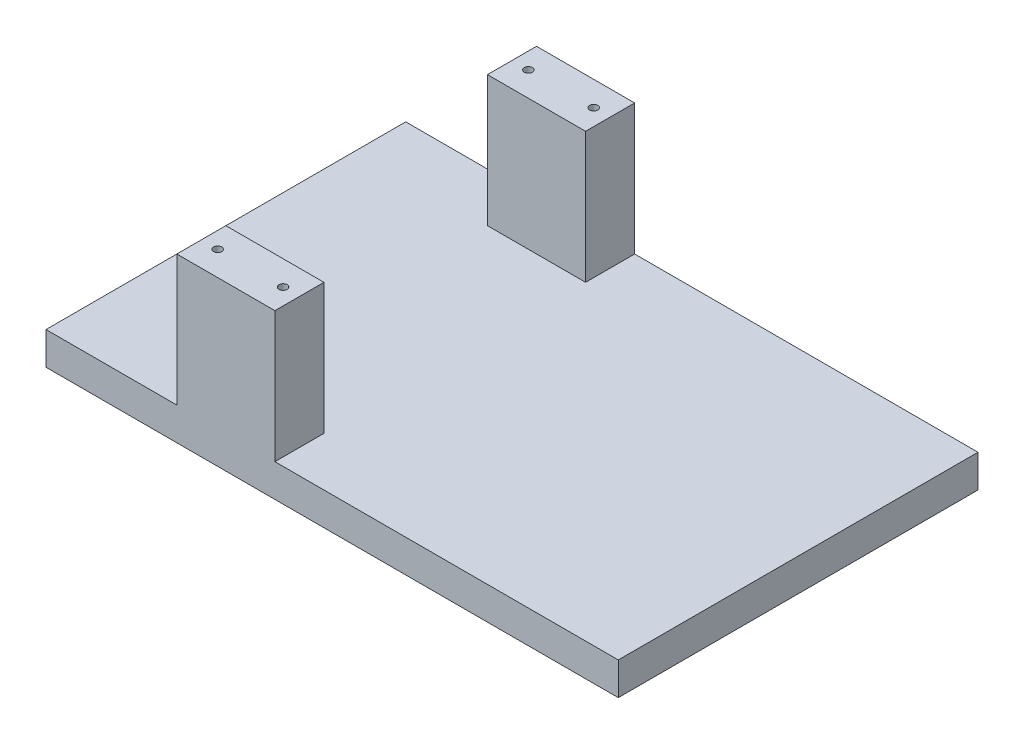
ISO-10303-21;
HEADER;
FILE_DESCRIPTION(('STEP AP214'),'2;1');
FILE_NAME('part.step','',(''),(''),'','','');
FILE_SCHEMA(('AUTOMOTIVE_DESIGN { 1 0 10303 214 1 1 1 1 }'));
ENDSEC;
DATA;
#1=APPLICATION_CONTEXT('core data for automotive mechanical design processes');
#2=APPLICATION_PROTOCOL_DEFINITION('international standard','automotive_design',2000,#1);
#3=PRODUCT_CONTEXT('',#1,'mechanical');
#4=PRODUCT('Part','Part','',(#3));
#5=PRODUCT_RELATED_PRODUCT_CATEGORY('part','',(#4));
#6=PRODUCT_DEFINITION_FORMATION('','',#4);
#7=PRODUCT_DEFINITION_CONTEXT('part definition',#1,'design');
#8=PRODUCT_DEFINITION('design','',#6,#7);
#9=PRODUCT_DEFINITION_SHAPE('','',#8);
#10=(LENGTH_UNIT() NAMED_UNIT(*) SI_UNIT(.MILLI.,.METRE.));
#11=(NAMED_UNIT(*) PLANE_ANGLE_UNIT() SI_UNIT($,.RADIAN.));
#12=(NAMED_UNIT(*) SI_UNIT($,.STERADIAN.) SOLID_ANGLE_UNIT());
#13=UNCERTAINTY_MEASURE_WITH_UNIT(LENGTH_MEASURE(1.E-05),#10,'distance_accuracy_value','');
#14=(GEOMETRIC_REPRESENTATION_CONTEXT(3) GLOBAL_UNCERTAINTY_ASSIGNED_CONTEXT((#13)) GLOBAL_UNIT_ASSIGNED_CONTEXT((#10,
#11,#12)) REPRESENTATION_CONTEXT('',''));
#15=CARTESIAN_POINT('',(0.,0.,0.));
#16=DIRECTION('',(0.,0.,1.));
#17=DIRECTION('',(1.,0.,0.));
#18=AXIS2_PLACEMENT_3D('',#15,#16,#17);
#19=CARTESIAN_POINT('',(0.,10.,-110.));
#20=DIRECTION('',(0.,-1.,0.));
#21=DIRECTION('',(0.,0.,-1.));
#22=AXIS2_PLACEMENT_3D('',#19,#20,#21);
#23=PLANE('',#22);
#24=DIRECTION('',(0.,0.,1.));
#25=VECTOR('',#24,1.);
#26=CARTESIAN_POINT('',(40.,10.,-110.));
#27=LINE('',#26,#25);
#28=CARTESIAN_POINT('',(40.,10.,-110.));
#29=VERTEX_POINT('',#28);
#30=CARTESIAN_POINT('',(40.,10.,-95.));
#31=VERTEX_POINT('',#30);
#32=EDGE_CURVE('E171',#29,#31,#27,.T.);
#33=ORIENTED_EDGE('',*,*,#32,.F.);
#34=DIRECTION('',(-1.,0.,0.));
#35=VECTOR('',#34,1.);
#36=CARTESIAN_POINT('',(0.,10.,-110.));
#37=LINE('',#36,#35);
#38=CARTESIAN_POINT('',(0.,10.,-110.));
#39=VERTEX_POINT('',#38);
#40=EDGE_CURVE('E249',#29,#39,#37,.T.);
#41=ORIENTED_EDGE('',*,*,#40,.T.);
#42=DIRECTION('',(0.,0.,1.));
#43=VECTOR('',#42,1.);
#44=CARTESIAN_POINT('',(0.,10.,0.));
#45=LINE('',#44,#43);
#46=CARTESIAN_POINT('',(0.,10.,0.));
#47=VERTEX_POINT('',#46);
#48=EDGE_CURVE('E217',#39,#47,#45,.T.);
#49=ORIENTED_EDGE('',*,*,#48,.T.);
#50=DIRECTION('',(1.,0.,0.));
#51=VECTOR('',#50,1.);
#52=CARTESIAN_POINT('',(0.,10.,0.));
#53=LINE('',#52,#51);
#54=CARTESIAN_POINT('',(40.,10.,0.));
#55=VERTEX_POINT('',#54);
#56=EDGE_CURVE('E230',#47,#55,#53,.T.);
#57=ORIENTED_EDGE('',*,*,#56,.T.);
#58=DIRECTION('',(0.,0.,1.));
#59=VECTOR('',#58,1.);
#60=CARTESIAN_POINT('',(40.,10.,0.));
#61=LINE('',#60,#59);
#62=CARTESIAN_POINT('',(40.,10.,-15.));
#63=VERTEX_POINT('',#62);
#64=EDGE_CURVE('E41',#63,#55,#61,.T.);
#65=ORIENTED_EDGE('',*,*,#64,.F.);
#66=DIRECTION('',(-1.,0.,0.));
#67=VECTOR('',#66,1.);
#68=CARTESIAN_POINT('',(40.,10.,-15.));
#69=LINE('',#68,#67);
#70=CARTESIAN_POINT('',(70.,10.,-15.));
#71=VERTEX_POINT('',#70);
#72=EDGE_CURVE('E200',#71,#63,#69,.T.);
#73=ORIENTED_EDGE('',*,*,#72,.F.);
#74=DIRECTION('',(0.,0.,-1.));
#75=VECTOR('',#74,1.);
#76=CARTESIAN_POINT('',(70.,10.,0.));
#77=LINE('',#76,#75);
#78=CARTESIAN_POINT('',(70.,10.,0.));
#79=VERTEX_POINT('',#78);
#80=EDGE_CURVE('E210',#79,#71,#77,.T.);
#81=ORIENTED_EDGE('',*,*,#80,.F.);
#82=CARTESIAN_POINT('',(175.,10.,0.));
#83=VERTEX_POINT('',#82);
#84=EDGE_CURVE('E220',#79,#83,#53,.T.);
#85=ORIENTED_EDGE('',*,*,#84,.T.);
#86=DIRECTION('',(0.,0.,-1.));
#87=VECTOR('',#86,1.);
#88=CARTESIAN_POINT('',(175.,10.,0.));
#89=LINE('',#88,#87);
#90=CARTESIAN_POINT('',(175.,10.,-110.));
#91=VERTEX_POINT('',#90);
#92=EDGE_CURVE('E224',#83,#91,#89,.T.);
#93=ORIENTED_EDGE('',*,*,#92,.T.);
#94=CARTESIAN_POINT('',(70.0000000000003,10.,-110.));
#95=VERTEX_POINT('',#94);
#96=EDGE_CURVE('E240',#91,#95,#37,.T.);
#97=ORIENTED_EDGE('',*,*,#96,.T.);
#98=DIRECTION('',(0.,0.,-1.));
#99=VECTOR('',#98,1.);
#100=CARTESIAN_POINT('',(70.0000000000003,10.,-110.));
#101=LINE('',#100,#99);
#102=CARTESIAN_POINT('',(70.,10.,-95.));
#103=VERTEX_POINT('',#102);
#104=EDGE_CURVE('E60',#103,#95,#101,.T.);
#105=ORIENTED_EDGE('',*,*,#104,.F.);
#106=DIRECTION('',(1.,0.,0.));
#107=VECTOR('',#106,1.);
#108=CARTESIAN_POINT('',(40.,10.,-95.));
#109=LINE('',#108,#107);
#110=EDGE_CURVE('E55',#31,#103,#109,.T.);
#111=ORIENTED_EDGE('',*,*,#110,.F.);
#112=EDGE_LOOP('',(#33,#41,#49,#57,#65,#73,#81,#85,#93,#97,#105,#111));
#113=FACE_BOUND('',#112,.T.);
#114=ADVANCED_FACE('F37',(#113),#23,.F.);
#115=CARTESIAN_POINT('',(0.,10.,0.));
#116=DIRECTION('',(1.,0.,0.));
#117=DIRECTION('',(0.,0.,-1.));
#118=AXIS2_PLACEMENT_3D('',#115,#116,#117);
#119=PLANE('',#118);
#120=DIRECTION('',(0.,0.,1.));
#121=VECTOR('',#120,1.);
#122=CARTESIAN_POINT('',(0.,0.,0.));
#123=LINE('',#122,#121);
#124=CARTESIAN_POINT('',(0.,0.,-110.));
#125=VERTEX_POINT('',#124);
#126=CARTESIAN_POINT('',(0.,0.,0.));
#127=VERTEX_POINT('',#126);
#128=EDGE_CURVE('E246',#125,#127,#123,.T.);
#129=ORIENTED_EDGE('',*,*,#128,.T.);
#130=DIRECTION('',(0.,-1.,0.));
#131=VECTOR('',#130,1.);
#132=CARTESIAN_POINT('',(0.,10.,0.));
#133=LINE('',#132,#131);
#134=EDGE_CURVE('E11',#47,#127,#133,.T.);
#135=ORIENTED_EDGE('',*,*,#134,.F.);
#136=ORIENTED_EDGE('',*,*,#48,.F.);
#137=DIRECTION('',(0.,-1.,0.));
#138=VECTOR('',#137,1.);
#139=CARTESIAN_POINT('',(0.,10.,-110.));
#140=LINE('',#139,#138);
#141=EDGE_CURVE('E237',#39,#125,#140,.T.);
#142=ORIENTED_EDGE('',*,*,#141,.T.);
#143=EDGE_LOOP('',(#129,#135,#136,#142));
#144=FACE_BOUND('',#143,.T.);
#145=ADVANCED_FACE('F39',(#144),#119,.F.);
#146=CARTESIAN_POINT('',(0.,10.,0.));
#147=DIRECTION('',(0.,0.,-1.));
#148=DIRECTION('',(-1.,0.,0.));
#149=AXIS2_PLACEMENT_3D('',#146,#147,#148);
#150=PLANE('',#149);
#151=DIRECTION('',(1.,0.,0.));
#152=VECTOR('',#151,1.);
#153=CARTESIAN_POINT('',(0.,0.,0.));
#154=LINE('',#153,#152);
#155=CARTESIAN_POINT('',(175.,0.,0.));
#156=VERTEX_POINT('',#155);
#157=EDGE_CURVE('E244',#127,#156,#154,.T.);
#158=ORIENTED_EDGE('',*,*,#157,.T.);
#159=DIRECTION('',(0.,-1.,0.));
#160=VECTOR('',#159,1.);
#161=CARTESIAN_POINT('',(175.,10.,0.));
#162=LINE('',#161,#160);
#163=EDGE_CURVE('E47',#83,#156,#162,.T.);
#164=ORIENTED_EDGE('',*,*,#163,.F.);
#165=ORIENTED_EDGE('',*,*,#84,.F.);
#166=DIRECTION('',(0.,-1.,0.));
#167=VECTOR('',#166,1.);
#168=CARTESIAN_POINT('',(70.,50.,0.));
#169=LINE('',#168,#167);
#170=CARTESIAN_POINT('',(70.,50.,0.));
#171=VERTEX_POINT('',#170);
#172=EDGE_CURVE('E216',#171,#79,#169,.T.);
#173=ORIENTED_EDGE('',*,*,#172,.F.);
#174=DIRECTION('',(1.,0.,0.));
#175=VECTOR('',#174,1.);
#176=CARTESIAN_POINT('',(40.,50.,0.));
#177=LINE('',#176,#175);
#178=CARTESIAN_POINT('',(40.,50.,0.));
#179=VERTEX_POINT('',#178);
#180=EDGE_CURVE('E199',#179,#171,#177,.T.);
#181=ORIENTED_EDGE('',*,*,#180,.F.);
#182=DIRECTION('',(0.,-1.,0.));
#183=VECTOR('',#182,1.);
#184=CARTESIAN_POINT('',(40.,50.,0.));
#185=LINE('',#184,#183);
#186=EDGE_CURVE('E248',#179,#55,#185,.T.);
#187=ORIENTED_EDGE('',*,*,#186,.T.);
#188=ORIENTED_EDGE('',*,*,#56,.F.);
#189=ORIENTED_EDGE('',*,*,#134,.T.);
#190=EDGE_LOOP('',(#158,#164,#165,#173,#181,#187,#188,#189));
#191=FACE_BOUND('',#190,.T.);
#192=ADVANCED_FACE('F283',(#191),#150,.F.);
#193=CARTESIAN_POINT('',(175.,10.,0.));
#194=DIRECTION('',(-1.,0.,0.));
#195=DIRECTION('',(0.,0.,1.));
#196=AXIS2_PLACEMENT_3D('',#193,#194,#195);
#197=PLANE('',#196);
#198=DIRECTION('',(0.,0.,-1.));
#199=VECTOR('',#198,1.);
#200=CARTESIAN_POINT('',(175.,0.,0.));
#201=LINE('',#200,#199);
#202=CARTESIAN_POINT('',(175.,0.,-110.));
#203=VERTEX_POINT('',#202);
#204=EDGE_CURVE('E242',#156,#203,#201,.T.);
#205=ORIENTED_EDGE('',*,*,#204,.T.);
#206=DIRECTION('',(0.,-1.,0.));
#207=VECTOR('',#206,1.);
#208=CARTESIAN_POINT('',(175.,10.,-110.));
#209=LINE('',#208,#207);
#210=EDGE_CURVE('E234',#91,#203,#209,.T.);
#211=ORIENTED_EDGE('',*,*,#210,.F.);
#212=ORIENTED_EDGE('',*,*,#92,.F.);
#213=ORIENTED_EDGE('',*,*,#163,.T.);
#214=EDGE_LOOP('',(#205,#211,#212,#213));
#215=FACE_BOUND('',#214,.T.);
#216=ADVANCED_FACE('F257',(#215),#197,.F.);
#217=CARTESIAN_POINT('',(0.,10.,-110.));
#218=DIRECTION('',(0.,0.,1.));
#219=DIRECTION('',(1.,0.,0.));
#220=AXIS2_PLACEMENT_3D('',#217,#218,#219);
#221=PLANE('',#220);
#222=DIRECTION('',(-1.,0.,0.));
#223=VECTOR('',#222,1.);
#224=CARTESIAN_POINT('',(0.,0.,-110.));
#225=LINE('',#224,#223);
#226=EDGE_CURVE('E221',#203,#125,#225,.T.);
#227=ORIENTED_EDGE('',*,*,#226,.T.);
#228=ORIENTED_EDGE('',*,*,#141,.F.);
#229=ORIENTED_EDGE('',*,*,#40,.F.);
#230=DIRECTION('',(0.,-1.,0.));
#231=VECTOR('',#230,1.);
#232=CARTESIAN_POINT('',(40.,50.,-110.));
#233=LINE('',#232,#231);
#234=CARTESIAN_POINT('',(40.,50.,-110.));
#235=VERTEX_POINT('',#234);
#236=EDGE_CURVE('E181',#235,#29,#233,.T.);
#237=ORIENTED_EDGE('',*,*,#236,.F.);
#238=DIRECTION('',(-1.,0.,0.));
#239=VECTOR('',#238,1.);
#240=CARTESIAN_POINT('',(40.,50.,-110.));
#241=LINE('',#240,#239);
#242=CARTESIAN_POINT('',(70.0000000000003,50.,-110.));
#243=VERTEX_POINT('',#242);
#244=EDGE_CURVE('E179',#243,#235,#241,.T.);
#245=ORIENTED_EDGE('',*,*,#244,.F.);
#246=DIRECTION('',(0.,-1.,0.));
#247=VECTOR('',#246,1.);
#248=CARTESIAN_POINT('',(70.0000000000003,50.,-110.));
#249=LINE('',#248,#247);
#250=EDGE_CURVE('E188',#243,#95,#249,.T.);
#251=ORIENTED_EDGE('',*,*,#250,.T.);
#252=ORIENTED_EDGE('',*,*,#96,.F.);
#253=ORIENTED_EDGE('',*,*,#210,.T.);
#254=EDGE_LOOP('',(#227,#228,#229,#237,#245,#251,#252,#253));
#255=FACE_BOUND('',#254,.T.);
#256=ADVANCED_FACE('F261',(#255),#221,.F.);
#257=CARTESIAN_POINT('',(0.,0.,-110.));
#258=DIRECTION('',(0.,-1.,0.));
#259=DIRECTION('',(0.,0.,-1.));
#260=AXIS2_PLACEMENT_3D('',#257,#258,#259);
#261=PLANE('',#260);
#262=ORIENTED_EDGE('',*,*,#128,.F.);
#263=ORIENTED_EDGE('',*,*,#226,.F.);
#264=ORIENTED_EDGE('',*,*,#204,.F.);
#265=ORIENTED_EDGE('',*,*,#157,.F.);
#266=EDGE_LOOP('',(#262,#263,#264,#265));
#267=FACE_BOUND('',#266,.T.);
#268=ADVANCED_FACE('F303',(#267),#261,.T.);
#269=CARTESIAN_POINT('',(40.,50.,0.));
#270=DIRECTION('',(1.,0.,0.));
#271=DIRECTION('',(0.,0.,-1.));
#272=AXIS2_PLACEMENT_3D('',#269,#270,#271);
#273=PLANE('',#272);
#274=ORIENTED_EDGE('',*,*,#64,.T.);
#275=ORIENTED_EDGE('',*,*,#186,.F.);
#276=DIRECTION('',(0.,0.,1.));
#277=VECTOR('',#276,1.);
#278=CARTESIAN_POINT('',(40.,50.,0.));
#279=LINE('',#278,#277);
#280=CARTESIAN_POINT('',(40.,50.,-15.));
#281=VERTEX_POINT('',#280);
#282=EDGE_CURVE('E196',#281,#179,#279,.T.);
#283=ORIENTED_EDGE('',*,*,#282,.F.);
#284=DIRECTION('',(0.,-1.,0.));
#285=VECTOR('',#284,1.);
#286=CARTESIAN_POINT('',(40.,50.,-15.));
#287=LINE('',#286,#285);
#288=EDGE_CURVE('E205',#281,#63,#287,.T.);
#289=ORIENTED_EDGE('',*,*,#288,.T.);
#290=EDGE_LOOP('',(#274,#275,#283,#289));
#291=FACE_BOUND('',#290,.T.);
#292=ADVANCED_FACE('F288',(#291),#273,.F.);
#293=CARTESIAN_POINT('',(70.,50.,0.));
#294=DIRECTION('',(-1.,0.,0.));
#295=DIRECTION('',(0.,0.,1.));
#296=AXIS2_PLACEMENT_3D('',#293,#294,#295);
#297=PLANE('',#296);
#298=ORIENTED_EDGE('',*,*,#80,.T.);
#299=DIRECTION('',(0.,-1.,0.));
#300=VECTOR('',#299,1.);
#301=CARTESIAN_POINT('',(70.,50.,-15.));
#302=LINE('',#301,#300);
#303=CARTESIAN_POINT('',(70.,50.,-15.));
#304=VERTEX_POINT('',#303);
#305=EDGE_CURVE('E213',#304,#71,#302,.T.);
#306=ORIENTED_EDGE('',*,*,#305,.F.);
#307=DIRECTION('',(0.,0.,-1.));
#308=VECTOR('',#307,1.);
#309=CARTESIAN_POINT('',(70.,50.,0.));
#310=LINE('',#309,#308);
#311=EDGE_CURVE('E202',#171,#304,#310,.T.);
#312=ORIENTED_EDGE('',*,*,#311,.F.);
#313=ORIENTED_EDGE('',*,*,#172,.T.);
#314=EDGE_LOOP('',(#298,#306,#312,#313));
#315=FACE_BOUND('',#314,.T.);
#316=ADVANCED_FACE('F301',(#315),#297,.F.);
#317=CARTESIAN_POINT('',(40.,50.,-15.));
#318=DIRECTION('',(0.,0.,1.));
#319=DIRECTION('',(1.,0.,0.));
#320=AXIS2_PLACEMENT_3D('',#317,#318,#319);
#321=PLANE('',#320);
#322=ORIENTED_EDGE('',*,*,#72,.T.);
#323=ORIENTED_EDGE('',*,*,#288,.F.);
#324=DIRECTION('',(-1.,0.,0.));
#325=VECTOR('',#324,1.);
#326=CARTESIAN_POINT('',(40.,50.,-15.));
#327=LINE('',#326,#325);
#328=EDGE_CURVE('E204',#304,#281,#327,.T.);
#329=ORIENTED_EDGE('',*,*,#328,.F.);
#330=ORIENTED_EDGE('',*,*,#305,.T.);
#331=EDGE_LOOP('',(#322,#323,#329,#330));
#332=FACE_BOUND('',#331,.T.);
#333=ADVANCED_FACE('F320',(#332),#321,.F.);
#334=CARTESIAN_POINT('',(40.,50.,-15.));
#335=DIRECTION('',(0.,-1.,0.));
#336=DIRECTION('',(0.,0.,-1.));
#337=AXIS2_PLACEMENT_3D('',#334,#335,#336);
#338=PLANE('',#337);
#339=CARTESIAN_POINT('',(45.,50.,-7.5));
#340=DIRECTION('',(0.,1.,0.));
#341=DIRECTION('',(0.,0.,1.));
#342=AXIS2_PLACEMENT_3D('',#339,#340,#341);
#343=CIRCLE('',#342,1.25);
#344=CARTESIAN_POINT('',(45.,50.,-6.25));
#345=VERTEX_POINT('',#344);
#346=EDGE_CURVE('E149',#345,#345,#343,.T.);
#347=ORIENTED_EDGE('',*,*,#346,.F.);
#348=EDGE_LOOP('',(#347));
#349=FACE_BOUND('',#348,.T.);
#350=CARTESIAN_POINT('',(65.,50.,-7.5));
#351=DIRECTION('',(0.,1.,0.));
#352=DIRECTION('',(0.,0.,1.));
#353=AXIS2_PLACEMENT_3D('',#350,#351,#352);
#354=CIRCLE('',#353,1.25);
#355=CARTESIAN_POINT('',(65.,50.,-6.25));
#356=VERTEX_POINT('',#355);
#357=EDGE_CURVE('E148',#356,#356,#354,.T.);
#358=ORIENTED_EDGE('',*,*,#357,.F.);
#359=EDGE_LOOP('',(#358));
#360=FACE_BOUND('',#359,.T.);
#361=ORIENTED_EDGE('',*,*,#282,.T.);
#362=ORIENTED_EDGE('',*,*,#180,.T.);
#363=ORIENTED_EDGE('',*,*,#311,.T.);
#364=ORIENTED_EDGE('',*,*,#328,.T.);
#365=EDGE_LOOP('',(#361,#362,#363,#364));
#366=FACE_BOUND('',#365,.T.);
#367=ADVANCED_FACE('F323',(#349,#360,#366),#338,.F.);
#368=CARTESIAN_POINT('',(40.,50.,-110.));
#369=DIRECTION('',(1.,0.,0.));
#370=DIRECTION('',(0.,0.,-1.));
#371=AXIS2_PLACEMENT_3D('',#368,#369,#370);
#372=PLANE('',#371);
#373=ORIENTED_EDGE('',*,*,#32,.T.);
#374=DIRECTION('',(0.,-1.,0.));
#375=VECTOR('',#374,1.);
#376=CARTESIAN_POINT('',(40.,50.,-95.));
#377=LINE('',#376,#375);
#378=CARTESIAN_POINT('',(40.,50.,-95.));
#379=VERTEX_POINT('',#378);
#380=EDGE_CURVE('E194',#379,#31,#377,.T.);
#381=ORIENTED_EDGE('',*,*,#380,.F.);
#382=DIRECTION('',(0.,0.,1.));
#383=VECTOR('',#382,1.);
#384=CARTESIAN_POINT('',(40.,50.,-110.));
#385=LINE('',#384,#383);
#386=EDGE_CURVE('E172',#235,#379,#385,.T.);
#387=ORIENTED_EDGE('',*,*,#386,.F.);
#388=ORIENTED_EDGE('',*,*,#236,.T.);
#389=EDGE_LOOP('',(#373,#381,#387,#388));
#390=FACE_BOUND('',#389,.T.);
#391=ADVANCED_FACE('F274',(#390),#372,.F.);
#392=CARTESIAN_POINT('',(40.,50.,-95.));
#393=DIRECTION('',(0.,0.,-1.));
#394=DIRECTION('',(-1.,0.,0.));
#395=AXIS2_PLACEMENT_3D('',#392,#393,#394);
#396=PLANE('',#395);
#397=ORIENTED_EDGE('',*,*,#110,.T.);
#398=DIRECTION('',(0.,-1.,0.));
#399=VECTOR('',#398,1.);
#400=CARTESIAN_POINT('',(70.,50.,-95.));
#401=LINE('',#400,#399);
#402=CARTESIAN_POINT('',(70.,50.,-95.));
#403=VERTEX_POINT('',#402);
#404=EDGE_CURVE('E191',#403,#103,#401,.T.);
#405=ORIENTED_EDGE('',*,*,#404,.F.);
#406=DIRECTION('',(1.,0.,0.));
#407=VECTOR('',#406,1.);
#408=CARTESIAN_POINT('',(40.,50.,-95.));
#409=LINE('',#408,#407);
#410=EDGE_CURVE('E175',#379,#403,#409,.T.);
#411=ORIENTED_EDGE('',*,*,#410,.F.);
#412=ORIENTED_EDGE('',*,*,#380,.T.);
#413=EDGE_LOOP('',(#397,#405,#411,#412));
#414=FACE_BOUND('',#413,.T.);
#415=ADVANCED_FACE('F270',(#414),#396,.F.);
#416=CARTESIAN_POINT('',(70.0000000000003,50.,-110.));
#417=DIRECTION('',(-1.,0.,0.));
#418=DIRECTION('',(0.,0.,1.));
#419=AXIS2_PLACEMENT_3D('',#416,#417,#418);
#420=PLANE('',#419);
#421=ORIENTED_EDGE('',*,*,#104,.T.);
#422=ORIENTED_EDGE('',*,*,#250,.F.);
#423=DIRECTION('',(0.,0.,-1.));
#424=VECTOR('',#423,1.);
#425=CARTESIAN_POINT('',(70.0000000000003,50.,-110.));
#426=LINE('',#425,#424);
#427=EDGE_CURVE('E177',#403,#243,#426,.T.);
#428=ORIENTED_EDGE('',*,*,#427,.F.);
#429=ORIENTED_EDGE('',*,*,#404,.T.);
#430=EDGE_LOOP('',(#421,#422,#428,#429));
#431=FACE_BOUND('',#430,.T.);
#432=ADVANCED_FACE('F267',(#431),#420,.F.);
#433=CARTESIAN_POINT('',(40.,50.,-95.));
#434=DIRECTION('',(0.,1.,0.));
#435=DIRECTION('',(0.,0.,1.));
#436=AXIS2_PLACEMENT_3D('',#433,#434,#435);
#437=PLANE('',#436);
#438=CARTESIAN_POINT('',(45.,50.,-102.5));
#439=DIRECTION('',(0.,1.,0.));
#440=DIRECTION('',(0.,0.,1.));
#441=AXIS2_PLACEMENT_3D('',#438,#439,#440);
#442=CIRCLE('',#441,1.25);
#443=CARTESIAN_POINT('',(45.,50.,-101.25));
#444=VERTEX_POINT('',#443);
#445=EDGE_CURVE('E159',#444,#444,#442,.T.);
#446=ORIENTED_EDGE('',*,*,#445,.F.);
#447=EDGE_LOOP('',(#446));
#448=FACE_BOUND('',#447,.T.);
#449=CARTESIAN_POINT('',(65.,50.,-102.5));
#450=DIRECTION('',(0.,1.,0.));
#451=DIRECTION('',(0.,0.,1.));
#452=AXIS2_PLACEMENT_3D('',#449,#450,#451);
#453=CIRCLE('',#452,1.25);
#454=CARTESIAN_POINT('',(65.,50.,-101.25));
#455=VERTEX_POINT('',#454);
#456=EDGE_CURVE('E165',#455,#455,#453,.T.);
#457=ORIENTED_EDGE('',*,*,#456,.F.);
#458=EDGE_LOOP('',(#457));
#459=FACE_BOUND('',#458,.T.);
#460=ORIENTED_EDGE('',*,*,#386,.T.);
#461=ORIENTED_EDGE('',*,*,#410,.T.);
#462=ORIENTED_EDGE('',*,*,#427,.T.);
#463=ORIENTED_EDGE('',*,*,#244,.T.);
#464=EDGE_LOOP('',(#460,#461,#462,#463));
#465=FACE_BOUND('',#464,.T.);
#466=ADVANCED_FACE('F334',(#448,#459,#465),#437,.T.);
#467=CARTESIAN_POINT('',(65.,42.5,-102.5));
#468=DIRECTION('',(0.,1.,0.));
#469=DIRECTION('',(0.,0.,1.));
#470=AXIS2_PLACEMENT_3D('',#467,#468,#469);
#471=CONICAL_SURFACE('',#470,1.25,1.02974425867666);
#472=CARTESIAN_POINT('',(65.,41.7489242262155,-102.5));
#473=VERTEX_POINT('',#472);
#474=VERTEX_LOOP('',#473);
#475=FACE_BOUND('',#474,.T.);
#476=CARTESIAN_POINT('',(65.,42.5,-102.5));
#477=DIRECTION('',(0.,1.,0.));
#478=DIRECTION('',(0.,0.,1.));
#479=AXIS2_PLACEMENT_3D('',#476,#477,#478);
#480=CIRCLE('',#479,1.25);
#481=CARTESIAN_POINT('',(65.,42.5,-101.25));
#482=VERTEX_POINT('',#481);
#483=EDGE_CURVE('E168',#482,#482,#480,.T.);
#484=ORIENTED_EDGE('',*,*,#483,.T.);
#485=EDGE_LOOP('',(#484));
#486=FACE_BOUND('',#485,.T.);
#487=ADVANCED_FACE('F337',(#475,#486),#471,.F.);
#488=CARTESIAN_POINT('',(65.,50.,-102.5));
#489=DIRECTION('',(0.,1.,0.));
#490=DIRECTION('',(0.,0.,1.));
#491=AXIS2_PLACEMENT_3D('',#488,#489,#490);
#492=CYLINDRICAL_SURFACE('',#491,1.25);
#493=ORIENTED_EDGE('',*,*,#483,.F.);
#494=EDGE_LOOP('',(#493));
#495=FACE_BOUND('',#494,.T.);
#496=ORIENTED_EDGE('',*,*,#456,.T.);
#497=EDGE_LOOP('',(#496));
#498=FACE_BOUND('',#497,.T.);
#499=ADVANCED_FACE('F341',(#495,#498),#492,.F.);
#500=CARTESIAN_POINT('',(45.,42.5,-102.5));
#501=DIRECTION('',(0.,1.,0.));
#502=DIRECTION('',(0.,0.,1.));
#503=AXIS2_PLACEMENT_3D('',#500,#501,#502);
#504=CONICAL_SURFACE('',#503,1.24999999999999,1.02974425867665);
#505=CARTESIAN_POINT('',(45.,41.7489242262155,-102.5));
#506=VERTEX_POINT('',#505);
#507=VERTEX_LOOP('',#506);
#508=FACE_BOUND('',#507,.T.);
#509=CARTESIAN_POINT('',(45.,42.5,-102.5));
#510=DIRECTION('',(0.,1.,0.));
#511=DIRECTION('',(0.,0.,1.));
#512=AXIS2_PLACEMENT_3D('',#509,#510,#511);
#513=CIRCLE('',#512,1.24999999999999);
#514=CARTESIAN_POINT('',(45.,42.5,-101.25));
#515=VERTEX_POINT('',#514);
#516=EDGE_CURVE('E162',#515,#515,#513,.T.);
#517=ORIENTED_EDGE('',*,*,#516,.T.);
#518=EDGE_LOOP('',(#517));
#519=FACE_BOUND('',#518,.T.);
#520=ADVANCED_FACE('F345',(#508,#519),#504,.F.);
#521=CARTESIAN_POINT('',(45.,50.,-102.5));
#522=DIRECTION('',(0.,1.,0.));
#523=DIRECTION('',(0.,0.,1.));
#524=AXIS2_PLACEMENT_3D('',#521,#522,#523);
#525=CYLINDRICAL_SURFACE('',#524,1.25);
#526=ORIENTED_EDGE('',*,*,#516,.F.);
#527=EDGE_LOOP('',(#526));
#528=FACE_BOUND('',#527,.T.);
#529=ORIENTED_EDGE('',*,*,#445,.T.);
#530=EDGE_LOOP('',(#529));
#531=FACE_BOUND('',#530,.T.);
#532=ADVANCED_FACE('F349',(#528,#531),#525,.F.);
#533=CARTESIAN_POINT('',(65.,42.5,-7.5));
#534=DIRECTION('',(0.,1.,0.));
#535=DIRECTION('',(0.,0.,1.));
#536=AXIS2_PLACEMENT_3D('',#533,#534,#535);
#537=CONICAL_SURFACE('',#536,1.25,1.02974425867666);
#538=CARTESIAN_POINT('',(65.,41.7489242262155,-7.5));
#539=VERTEX_POINT('',#538);
#540=VERTEX_LOOP('',#539);
#541=FACE_BOUND('',#540,.T.);
#542=CARTESIAN_POINT('',(65.,42.5,-7.5));
#543=DIRECTION('',(0.,1.,0.));
#544=DIRECTION('',(0.,0.,1.));
#545=AXIS2_PLACEMENT_3D('',#542,#543,#544);
#546=CIRCLE('',#545,1.25);
#547=CARTESIAN_POINT('',(65.,42.5,-6.25));
#548=VERTEX_POINT('',#547);
#549=EDGE_CURVE('E152',#548,#548,#546,.T.);
#550=ORIENTED_EDGE('',*,*,#549,.T.);
#551=EDGE_LOOP('',(#550));
#552=FACE_BOUND('',#551,.T.);
#553=ADVANCED_FACE('F353',(#541,#552),#537,.F.);
#554=CARTESIAN_POINT('',(65.,50.,-7.5));
#555=DIRECTION('',(0.,1.,0.));
#556=DIRECTION('',(0.,0.,1.));
#557=AXIS2_PLACEMENT_3D('',#554,#555,#556);
#558=CYLINDRICAL_SURFACE('',#557,1.25);
#559=ORIENTED_EDGE('',*,*,#549,.F.);
#560=EDGE_LOOP('',(#559));
#561=FACE_BOUND('',#560,.T.);
#562=ORIENTED_EDGE('',*,*,#357,.T.);
#563=EDGE_LOOP('',(#562));
#564=FACE_BOUND('',#563,.T.);
#565=ADVANCED_FACE('F142',(#561,#564),#558,.F.);
#566=CARTESIAN_POINT('',(45.,42.5,-7.5));
#567=DIRECTION('',(0.,1.,0.));
#568=DIRECTION('',(0.,0.,1.));
#569=AXIS2_PLACEMENT_3D('',#566,#567,#568);
#570=CONICAL_SURFACE('',#569,1.24999999999999,1.02974425867665);
#571=CARTESIAN_POINT('',(45.,41.7489242262155,-7.5));
#572=VERTEX_POINT('',#571);
#573=VERTEX_LOOP('',#572);
#574=FACE_BOUND('',#573,.T.);
#575=CARTESIAN_POINT('',(45.,42.5,-7.5));
#576=DIRECTION('',(0.,1.,0.));
#577=DIRECTION('',(0.,0.,1.));
#578=AXIS2_PLACEMENT_3D('',#575,#576,#577);
#579=CIRCLE('',#578,1.24999999999999);
#580=CARTESIAN_POINT('',(45.,42.5,-6.25000000000001));
#581=VERTEX_POINT('',#580);
#582=EDGE_CURVE('E146',#581,#581,#579,.T.);
#583=ORIENTED_EDGE('',*,*,#582,.T.);
#584=EDGE_LOOP('',(#583));
#585=FACE_BOUND('',#584,.T.);
#586=ADVANCED_FACE('F138',(#574,#585),#570,.F.);
#587=CARTESIAN_POINT('',(45.,50.,-7.5));
#588=DIRECTION('',(0.,1.,0.));
#589=DIRECTION('',(0.,0.,1.));
#590=AXIS2_PLACEMENT_3D('',#587,#588,#589);
#591=CYLINDRICAL_SURFACE('',#590,1.25);
#592=ORIENTED_EDGE('',*,*,#582,.F.);
#593=EDGE_LOOP('',(#592));
#594=FACE_BOUND('',#593,.T.);
#595=ORIENTED_EDGE('',*,*,#346,.T.);
#596=EDGE_LOOP('',(#595));
#597=FACE_BOUND('',#596,.T.);
#598=ADVANCED_FACE('F141',(#594,#597),#591,.F.);
#599=CLOSED_SHELL('',(#114,#145,#192,#216,#256,#268,#292,#316,#333,#367,#391,#415,#432,#466,
#487,#499,#520,#532,#553,#565,#586,#598));
#600=MANIFOLD_SOLID_BREP('B2',#599);
#601=ADVANCED_BREP_SHAPE_REPRESENTATION('',(#18,#600),#14);
#602=SHAPE_DEFINITION_REPRESENTATION(#9,#601);
ENDSEC;
END-ISO-10303-21;
